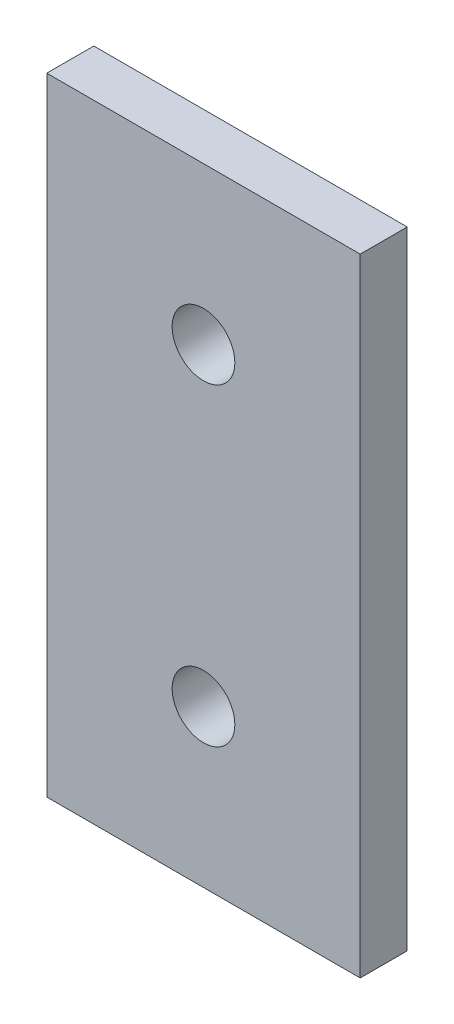
ISO-10303-21;
HEADER;
FILE_DESCRIPTION(('STEP AP214'),'2;1');
FILE_NAME('part.step','',(''),(''),'','','');
FILE_SCHEMA(('AUTOMOTIVE_DESIGN { 1 0 10303 214 1 1 1 1 }'));
ENDSEC;
DATA;
#1=APPLICATION_CONTEXT('core data for automotive mechanical design processes');
#2=APPLICATION_PROTOCOL_DEFINITION('international standard','automotive_design',2000,#1);
#3=PRODUCT_CONTEXT('',#1,'mechanical');
#4=PRODUCT('Part','Part','',(#3));
#5=PRODUCT_RELATED_PRODUCT_CATEGORY('part','',(#4));
#6=PRODUCT_DEFINITION_FORMATION('','',#4);
#7=PRODUCT_DEFINITION_CONTEXT('part definition',#1,'design');
#8=PRODUCT_DEFINITION('design','',#6,#7);
#9=PRODUCT_DEFINITION_SHAPE('','',#8);
#10=(LENGTH_UNIT() NAMED_UNIT(*) SI_UNIT(.MILLI.,.METRE.));
#11=(NAMED_UNIT(*) PLANE_ANGLE_UNIT() SI_UNIT($,.RADIAN.));
#12=(NAMED_UNIT(*) SI_UNIT($,.STERADIAN.) SOLID_ANGLE_UNIT());
#13=UNCERTAINTY_MEASURE_WITH_UNIT(LENGTH_MEASURE(1.E-05),#10,'distance_accuracy_value','');
#14=(GEOMETRIC_REPRESENTATION_CONTEXT(3) GLOBAL_UNCERTAINTY_ASSIGNED_CONTEXT((#13)) GLOBAL_UNIT_ASSIGNED_CONTEXT((#10,
#11,#12)) REPRESENTATION_CONTEXT('',''));
#15=CARTESIAN_POINT('',(0.,0.,0.));
#16=DIRECTION('',(0.,0.,1.));
#17=DIRECTION('',(1.,0.,0.));
#18=AXIS2_PLACEMENT_3D('',#15,#16,#17);
#19=CARTESIAN_POINT('',(0.,0.,3.));
#20=DIRECTION('',(1.,0.,0.));
#21=DIRECTION('',(0.,0.,-1.));
#22=AXIS2_PLACEMENT_3D('',#19,#20,#21);
#23=PLANE('',#22);
#24=DIRECTION('',(0.,-1.,0.));
#25=VECTOR('',#24,1.);
#26=CARTESIAN_POINT('',(0.,0.,0.));
#27=LINE('',#26,#25);
#28=CARTESIAN_POINT('',(0.,40.,0.));
#29=VERTEX_POINT('',#28);
#30=CARTESIAN_POINT('',(0.,0.,0.));
#31=VERTEX_POINT('',#30);
#32=EDGE_CURVE('E95',#29,#31,#27,.T.);
#33=ORIENTED_EDGE('',*,*,#32,.T.);
#34=DIRECTION('',(0.,0.,-1.));
#35=VECTOR('',#34,1.);
#36=CARTESIAN_POINT('',(0.,0.,3.));
#37=LINE('',#36,#35);
#38=CARTESIAN_POINT('',(0.,0.,3.));
#39=VERTEX_POINT('',#38);
#40=EDGE_CURVE('E11',#39,#31,#37,.T.);
#41=ORIENTED_EDGE('',*,*,#40,.F.);
#42=DIRECTION('',(0.,-1.,0.));
#43=VECTOR('',#42,1.);
#44=CARTESIAN_POINT('',(0.,0.,3.));
#45=LINE('',#44,#43);
#46=CARTESIAN_POINT('',(0.,40.,3.));
#47=VERTEX_POINT('',#46);
#48=EDGE_CURVE('E83',#47,#39,#45,.T.);
#49=ORIENTED_EDGE('',*,*,#48,.F.);
#50=DIRECTION('',(0.,0.,-1.));
#51=VECTOR('',#50,1.);
#52=CARTESIAN_POINT('',(0.,40.,3.));
#53=LINE('',#52,#51);
#54=EDGE_CURVE('E91',#47,#29,#53,.T.);
#55=ORIENTED_EDGE('',*,*,#54,.T.);
#56=EDGE_LOOP('',(#33,#41,#49,#55));
#57=FACE_BOUND('',#56,.T.);
#58=ADVANCED_FACE('F32',(#57),#23,.F.);
#59=CARTESIAN_POINT('',(0.,0.,3.));
#60=DIRECTION('',(0.,1.,0.));
#61=DIRECTION('',(0.,0.,1.));
#62=AXIS2_PLACEMENT_3D('',#59,#60,#61);
#63=PLANE('',#62);
#64=DIRECTION('',(1.,0.,0.));
#65=VECTOR('',#64,1.);
#66=CARTESIAN_POINT('',(0.,0.,0.));
#67=LINE('',#66,#65);
#68=CARTESIAN_POINT('',(20.,0.,0.));
#69=VERTEX_POINT('',#68);
#70=EDGE_CURVE('E87',#31,#69,#67,.T.);
#71=ORIENTED_EDGE('',*,*,#70,.T.);
#72=DIRECTION('',(0.,0.,-1.));
#73=VECTOR('',#72,1.);
#74=CARTESIAN_POINT('',(20.,0.,3.));
#75=LINE('',#74,#73);
#76=CARTESIAN_POINT('',(20.,0.,3.));
#77=VERTEX_POINT('',#76);
#78=EDGE_CURVE('E40',#77,#69,#75,.T.);
#79=ORIENTED_EDGE('',*,*,#78,.F.);
#80=DIRECTION('',(1.,0.,0.));
#81=VECTOR('',#80,1.);
#82=CARTESIAN_POINT('',(0.,0.,3.));
#83=LINE('',#82,#81);
#84=EDGE_CURVE('E78',#39,#77,#83,.T.);
#85=ORIENTED_EDGE('',*,*,#84,.F.);
#86=ORIENTED_EDGE('',*,*,#40,.T.);
#87=EDGE_LOOP('',(#71,#79,#85,#86));
#88=FACE_BOUND('',#87,.T.);
#89=ADVANCED_FACE('F86',(#88),#63,.F.);
#90=CARTESIAN_POINT('',(20.,0.,3.));
#91=DIRECTION('',(-1.,0.,0.));
#92=DIRECTION('',(0.,0.,1.));
#93=AXIS2_PLACEMENT_3D('',#90,#91,#92);
#94=PLANE('',#93);
#95=DIRECTION('',(0.,1.,0.));
#96=VECTOR('',#95,1.);
#97=CARTESIAN_POINT('',(20.,0.,0.));
#98=LINE('',#97,#96);
#99=CARTESIAN_POINT('',(20.,40.,0.));
#100=VERTEX_POINT('',#99);
#101=EDGE_CURVE('E65',#69,#100,#98,.T.);
#102=ORIENTED_EDGE('',*,*,#101,.T.);
#103=DIRECTION('',(0.,0.,-1.));
#104=VECTOR('',#103,1.);
#105=CARTESIAN_POINT('',(20.,40.,3.));
#106=LINE('',#105,#104);
#107=CARTESIAN_POINT('',(20.,40.,3.));
#108=VERTEX_POINT('',#107);
#109=EDGE_CURVE('E88',#108,#100,#106,.T.);
#110=ORIENTED_EDGE('',*,*,#109,.F.);
#111=DIRECTION('',(0.,1.,0.));
#112=VECTOR('',#111,1.);
#113=CARTESIAN_POINT('',(20.,0.,3.));
#114=LINE('',#113,#112);
#115=EDGE_CURVE('E81',#77,#108,#114,.T.);
#116=ORIENTED_EDGE('',*,*,#115,.F.);
#117=ORIENTED_EDGE('',*,*,#78,.T.);
#118=EDGE_LOOP('',(#102,#110,#116,#117));
#119=FACE_BOUND('',#118,.T.);
#120=ADVANCED_FACE('F89',(#119),#94,.F.);
#121=CARTESIAN_POINT('',(0.,40.,3.));
#122=DIRECTION('',(0.,-1.,0.));
#123=DIRECTION('',(0.,0.,-1.));
#124=AXIS2_PLACEMENT_3D('',#121,#122,#123);
#125=PLANE('',#124);
#126=DIRECTION('',(-1.,0.,0.));
#127=VECTOR('',#126,1.);
#128=CARTESIAN_POINT('',(0.,40.,0.));
#129=LINE('',#128,#127);
#130=EDGE_CURVE('E71',#100,#29,#129,.T.);
#131=ORIENTED_EDGE('',*,*,#130,.T.);
#132=ORIENTED_EDGE('',*,*,#54,.F.);
#133=DIRECTION('',(-1.,0.,0.));
#134=VECTOR('',#133,1.);
#135=CARTESIAN_POINT('',(0.,40.,3.));
#136=LINE('',#135,#134);
#137=EDGE_CURVE('E48',#108,#47,#136,.T.);
#138=ORIENTED_EDGE('',*,*,#137,.F.);
#139=ORIENTED_EDGE('',*,*,#109,.T.);
#140=EDGE_LOOP('',(#131,#132,#138,#139));
#141=FACE_BOUND('',#140,.T.);
#142=ADVANCED_FACE('F103',(#141),#125,.F.);
#143=CARTESIAN_POINT('',(0.,0.,3.));
#144=DIRECTION('',(0.,0.,-1.));
#145=DIRECTION('',(-1.,0.,0.));
#146=AXIS2_PLACEMENT_3D('',#143,#144,#145);
#147=PLANE('',#146);
#148=CARTESIAN_POINT('',(10.,30.,3.));
#149=DIRECTION('',(0.,0.,1.));
#150=DIRECTION('',(1.,0.,0.));
#151=AXIS2_PLACEMENT_3D('',#148,#149,#150);
#152=CIRCLE('',#151,2.);
#153=CARTESIAN_POINT('',(12.,30.,3.));
#154=VERTEX_POINT('',#153);
#155=EDGE_CURVE('E115',#154,#154,#152,.T.);
#156=ORIENTED_EDGE('',*,*,#155,.F.);
#157=EDGE_LOOP('',(#156));
#158=FACE_BOUND('',#157,.T.);
#159=CARTESIAN_POINT('',(10.,10.,3.));
#160=DIRECTION('',(0.,0.,1.));
#161=DIRECTION('',(1.,0.,0.));
#162=AXIS2_PLACEMENT_3D('',#159,#160,#161);
#163=CIRCLE('',#162,2.);
#164=CARTESIAN_POINT('',(12.,10.,3.));
#165=VERTEX_POINT('',#164);
#166=EDGE_CURVE('E109',#165,#165,#163,.T.);
#167=ORIENTED_EDGE('',*,*,#166,.F.);
#168=EDGE_LOOP('',(#167));
#169=FACE_BOUND('',#168,.T.);
#170=ORIENTED_EDGE('',*,*,#48,.T.);
#171=ORIENTED_EDGE('',*,*,#84,.T.);
#172=ORIENTED_EDGE('',*,*,#115,.T.);
#173=ORIENTED_EDGE('',*,*,#137,.T.);
#174=EDGE_LOOP('',(#170,#171,#172,#173));
#175=FACE_BOUND('',#174,.T.);
#176=ADVANCED_FACE('F79',(#158,#169,#175),#147,.F.);
#177=CARTESIAN_POINT('',(0.,0.,0.));
#178=DIRECTION('',(0.,0.,-1.));
#179=DIRECTION('',(-1.,0.,0.));
#180=AXIS2_PLACEMENT_3D('',#177,#178,#179);
#181=PLANE('',#180);
#182=CARTESIAN_POINT('',(10.,30.,0.));
#183=DIRECTION('',(0.,0.,1.));
#184=DIRECTION('',(1.,0.,0.));
#185=AXIS2_PLACEMENT_3D('',#182,#183,#184);
#186=CIRCLE('',#185,2.);
#187=CARTESIAN_POINT('',(12.,30.,0.));
#188=VERTEX_POINT('',#187);
#189=EDGE_CURVE('E112',#188,#188,#186,.T.);
#190=ORIENTED_EDGE('',*,*,#189,.T.);
#191=EDGE_LOOP('',(#190));
#192=FACE_BOUND('',#191,.T.);
#193=CARTESIAN_POINT('',(10.,10.,0.));
#194=DIRECTION('',(0.,0.,1.));
#195=DIRECTION('',(1.,0.,0.));
#196=AXIS2_PLACEMENT_3D('',#193,#194,#195);
#197=CIRCLE('',#196,2.);
#198=CARTESIAN_POINT('',(12.,10.,0.));
#199=VERTEX_POINT('',#198);
#200=EDGE_CURVE('E98',#199,#199,#197,.T.);
#201=ORIENTED_EDGE('',*,*,#200,.T.);
#202=EDGE_LOOP('',(#201));
#203=FACE_BOUND('',#202,.T.);
#204=ORIENTED_EDGE('',*,*,#32,.F.);
#205=ORIENTED_EDGE('',*,*,#130,.F.);
#206=ORIENTED_EDGE('',*,*,#101,.F.);
#207=ORIENTED_EDGE('',*,*,#70,.F.);
#208=EDGE_LOOP('',(#204,#205,#206,#207));
#209=FACE_BOUND('',#208,.T.);
#210=ADVANCED_FACE('F106',(#192,#203,#209),#181,.T.);
#211=CARTESIAN_POINT('',(10.,10.,0.));
#212=DIRECTION('',(0.,0.,1.));
#213=DIRECTION('',(1.,0.,0.));
#214=AXIS2_PLACEMENT_3D('',#211,#212,#213);
#215=CYLINDRICAL_SURFACE('',#214,2.);
#216=ORIENTED_EDGE('',*,*,#200,.F.);
#217=EDGE_LOOP('',(#216));
#218=FACE_BOUND('',#217,.T.);
#219=ORIENTED_EDGE('',*,*,#166,.T.);
#220=EDGE_LOOP('',(#219));
#221=FACE_BOUND('',#220,.T.);
#222=ADVANCED_FACE('F126',(#218,#221),#215,.F.);
#223=CARTESIAN_POINT('',(10.,30.,0.));
#224=DIRECTION('',(0.,0.,1.));
#225=DIRECTION('',(1.,0.,0.));
#226=AXIS2_PLACEMENT_3D('',#223,#224,#225);
#227=CYLINDRICAL_SURFACE('',#226,2.);
#228=ORIENTED_EDGE('',*,*,#189,.F.);
#229=EDGE_LOOP('',(#228));
#230=FACE_BOUND('',#229,.T.);
#231=ORIENTED_EDGE('',*,*,#155,.T.);
#232=EDGE_LOOP('',(#231));
#233=FACE_BOUND('',#232,.T.);
#234=ADVANCED_FACE('F123',(#230,#233),#227,.F.);
#235=CLOSED_SHELL('',(#58,#89,#120,#142,#176,#210,#222,#234));
#236=MANIFOLD_SOLID_BREP('B2',#235);
#237=ADVANCED_BREP_SHAPE_REPRESENTATION('',(#18,#236),#14);
#238=SHAPE_DEFINITION_REPRESENTATION(#9,#237);
ENDSEC;
END-ISO-10303-21;
